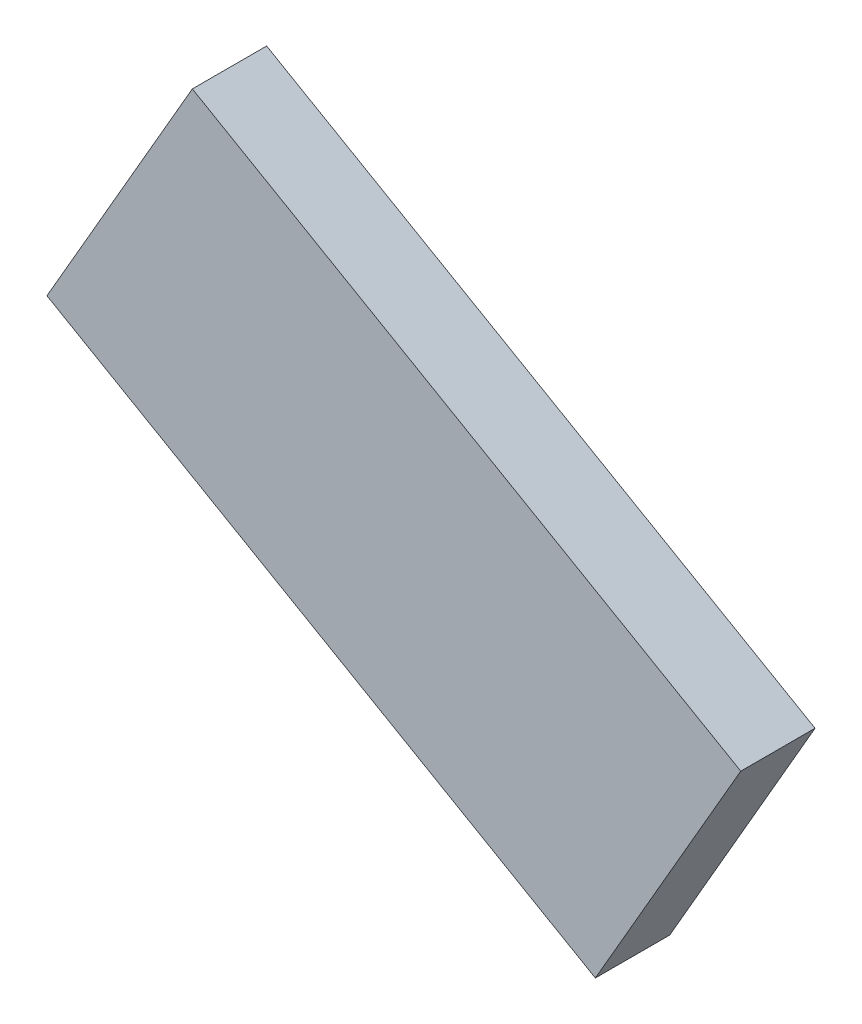
ISO-10303-21;
HEADER;
FILE_DESCRIPTION(('STEP AP214'),'2;1');
FILE_NAME('part.step','',(''),(''),'','','');
FILE_SCHEMA(('AUTOMOTIVE_DESIGN { 1 0 10303 214 1 1 1 1 }'));
ENDSEC;
DATA;
#1=APPLICATION_CONTEXT('core data for automotive mechanical design processes');
#2=APPLICATION_PROTOCOL_DEFINITION('international standard','automotive_design',2000,#1);
#3=PRODUCT_CONTEXT('',#1,'mechanical');
#4=PRODUCT('Part','Part','',(#3));
#5=PRODUCT_RELATED_PRODUCT_CATEGORY('part','',(#4));
#6=PRODUCT_DEFINITION_FORMATION('','',#4);
#7=PRODUCT_DEFINITION_CONTEXT('part definition',#1,'design');
#8=PRODUCT_DEFINITION('design','',#6,#7);
#9=PRODUCT_DEFINITION_SHAPE('','',#8);
#10=(LENGTH_UNIT() NAMED_UNIT(*) SI_UNIT(.MILLI.,.METRE.));
#11=(NAMED_UNIT(*) PLANE_ANGLE_UNIT() SI_UNIT($,.RADIAN.));
#12=(NAMED_UNIT(*) SI_UNIT($,.STERADIAN.) SOLID_ANGLE_UNIT());
#13=UNCERTAINTY_MEASURE_WITH_UNIT(LENGTH_MEASURE(1.E-05),#10,'distance_accuracy_value','');
#14=(GEOMETRIC_REPRESENTATION_CONTEXT(3) GLOBAL_UNCERTAINTY_ASSIGNED_CONTEXT((#13)) GLOBAL_UNIT_ASSIGNED_CONTEXT((#10,
#11,#12)) REPRESENTATION_CONTEXT('',''));
#15=CARTESIAN_POINT('',(0.,0.,0.));
#16=DIRECTION('',(0.,0.,1.));
#17=DIRECTION('',(1.,0.,0.));
#18=AXIS2_PLACEMENT_3D('',#15,#16,#17);
#19=CARTESIAN_POINT('',(5.36852622,-0.50144172,1.15000024));
#20=DIRECTION('',(0.,0.,-1.));
#21=DIRECTION('',(-1.,0.,0.));
#22=AXIS2_PLACEMENT_3D('',#19,#20,#21);
#23=PLANE('',#22);
#24=DIRECTION('',(0.500000090607198,0.866025351472342,0.));
#25=VECTOR('',#24,1.);
#26=CARTESIAN_POINT('',(-3.1185231,4.39855864,1.15000024));
#27=LINE('',#26,#25);
#28=CARTESIAN_POINT('',(-3.11852309999984,4.39855864000029,1.15000024));
#29=VERTEX_POINT('',#28);
#30=CARTESIAN_POINT('',(-5.36852367999981,0.501444259999892,1.15000024));
#31=VERTEX_POINT('',#30);
#32=EDGE_CURVE('E54',#29,#31,#27,.F.);
#33=ORIENTED_EDGE('',*,*,#32,.T.);
#34=DIRECTION('',(-0.866025397135755,0.500000011515858,0.));
#35=VECTOR('',#34,1.);
#36=CARTESIAN_POINT('',(-5.36852368,0.50144426,1.15000024));
#37=LINE('',#36,#35);
#38=CARTESIAN_POINT('',(3.11852563999984,-4.39855610000029,1.15000024));
#39=VERTEX_POINT('',#38);
#40=EDGE_CURVE('E56',#31,#39,#37,.F.);
#41=ORIENTED_EDGE('',*,*,#40,.T.);
#42=DIRECTION('',(-0.500000090607198,-0.866025351472342,0.));
#43=VECTOR('',#42,1.);
#44=CARTESIAN_POINT('',(3.11852564,-4.3985561,1.15000024));
#45=LINE('',#44,#43);
#46=CARTESIAN_POINT('',(5.36852621999963,-0.501441719999784,1.15000024));
#47=VERTEX_POINT('',#46);
#48=EDGE_CURVE('E19',#39,#47,#45,.F.);
#49=ORIENTED_EDGE('',*,*,#48,.T.);
#50=DIRECTION('',(0.866025397135755,-0.500000011515858,0.));
#51=VECTOR('',#50,1.);
#52=CARTESIAN_POINT('',(5.36852622,-0.50144172,1.15000024));
#53=LINE('',#52,#51);
#54=EDGE_CURVE('E79',#47,#29,#53,.F.);
#55=ORIENTED_EDGE('',*,*,#54,.T.);
#56=EDGE_LOOP('',(#33,#41,#49,#55));
#57=FACE_BOUND('',#56,.T.);
#58=ADVANCED_FACE('F16',(#57),#23,.F.);
#59=CARTESIAN_POINT('',(3.11852564,-4.3985561,0.));
#60=DIRECTION('',(-0.866025351472342,0.500000090607198,0.));
#61=DIRECTION('',(-0.500000090607198,-0.866025351472342,0.));
#62=AXIS2_PLACEMENT_3D('',#59,#60,#61);
#63=PLANE('',#62);
#64=DIRECTION('',(0.,0.,1.));
#65=VECTOR('',#64,1.);
#66=CARTESIAN_POINT('',(5.36852622,-0.50144172,0.));
#67=LINE('',#66,#65);
#68=CARTESIAN_POINT('',(5.36852621999963,-0.501441719999784,0.));
#69=VERTEX_POINT('',#68);
#70=EDGE_CURVE('E67',#69,#47,#67,.T.);
#71=ORIENTED_EDGE('',*,*,#70,.T.);
#72=ORIENTED_EDGE('',*,*,#48,.F.);
#73=DIRECTION('',(0.,0.,1.));
#74=VECTOR('',#73,1.);
#75=CARTESIAN_POINT('',(3.11852563999934,-4.39855610000114,0.));
#76=LINE('',#75,#74);
#77=CARTESIAN_POINT('',(3.11852563999984,-4.39855610000029,0.));
#78=VERTEX_POINT('',#77);
#79=EDGE_CURVE('E62',#39,#78,#76,.F.);
#80=ORIENTED_EDGE('',*,*,#79,.T.);
#81=DIRECTION('',(-0.500000090607363,-0.866025351472247,0.));
#82=VECTOR('',#81,1.);
#83=CARTESIAN_POINT('',(5.36852622,-0.50144172,0.));
#84=LINE('',#83,#82);
#85=EDGE_CURVE('E82',#69,#78,#84,.T.);
#86=ORIENTED_EDGE('',*,*,#85,.F.);
#87=EDGE_LOOP('',(#71,#72,#80,#86));
#88=FACE_BOUND('',#87,.T.);
#89=ADVANCED_FACE('F64',(#88),#63,.F.);
#90=CARTESIAN_POINT('',(-5.36852368,0.50144426,0.));
#91=DIRECTION('',(0.500000011515858,0.866025397135755,0.));
#92=DIRECTION('',(-0.866025397135755,0.500000011515858,0.));
#93=AXIS2_PLACEMENT_3D('',#90,#91,#92);
#94=PLANE('',#93);
#95=ORIENTED_EDGE('',*,*,#79,.F.);
#96=ORIENTED_EDGE('',*,*,#40,.F.);
#97=DIRECTION('',(0.,0.,1.));
#98=VECTOR('',#97,1.);
#99=CARTESIAN_POINT('',(-5.36852367999925,0.501444259999569,0.));
#100=LINE('',#99,#98);
#101=CARTESIAN_POINT('',(-5.36852367999981,0.501444259999892,0.));
#102=VERTEX_POINT('',#101);
#103=EDGE_CURVE('E74',#31,#102,#100,.F.);
#104=ORIENTED_EDGE('',*,*,#103,.T.);
#105=DIRECTION('',(-0.866025397135822,0.500000011515742,0.));
#106=VECTOR('',#105,1.);
#107=CARTESIAN_POINT('',(3.11852564,-4.3985561,0.));
#108=LINE('',#107,#106);
#109=EDGE_CURVE('E71',#78,#102,#108,.T.);
#110=ORIENTED_EDGE('',*,*,#109,.F.);
#111=EDGE_LOOP('',(#95,#96,#104,#110));
#112=FACE_BOUND('',#111,.T.);
#113=ADVANCED_FACE('F69',(#112),#94,.F.);
#114=CARTESIAN_POINT('',(-3.1185231,4.39855864,0.));
#115=DIRECTION('',(0.866025351472342,-0.500000090607198,0.));
#116=DIRECTION('',(0.500000090607198,0.866025351472342,0.));
#117=AXIS2_PLACEMENT_3D('',#114,#115,#116);
#118=PLANE('',#117);
#119=ORIENTED_EDGE('',*,*,#103,.F.);
#120=ORIENTED_EDGE('',*,*,#32,.F.);
#121=DIRECTION('',(0.,0.,1.));
#122=VECTOR('',#121,1.);
#123=CARTESIAN_POINT('',(-3.11852309999934,4.39855864000114,0.));
#124=LINE('',#123,#122);
#125=CARTESIAN_POINT('',(-3.11852309999984,4.39855864000029,0.));
#126=VERTEX_POINT('',#125);
#127=EDGE_CURVE('E34',#29,#126,#124,.F.);
#128=ORIENTED_EDGE('',*,*,#127,.T.);
#129=DIRECTION('',(0.500000090607363,0.866025351472247,0.));
#130=VECTOR('',#129,1.);
#131=CARTESIAN_POINT('',(-5.36852368,0.50144426,0.));
#132=LINE('',#131,#130);
#133=EDGE_CURVE('E25',#102,#126,#132,.T.);
#134=ORIENTED_EDGE('',*,*,#133,.F.);
#135=EDGE_LOOP('',(#119,#120,#128,#134));
#136=FACE_BOUND('',#135,.T.);
#137=ADVANCED_FACE('F88',(#136),#118,.F.);
#138=CARTESIAN_POINT('',(5.36852622,-0.50144172,0.));
#139=DIRECTION('',(-0.500000011515858,-0.866025397135755,0.));
#140=DIRECTION('',(0.866025397135755,-0.500000011515858,0.));
#141=AXIS2_PLACEMENT_3D('',#138,#139,#140);
#142=PLANE('',#141);
#143=ORIENTED_EDGE('',*,*,#127,.F.);
#144=ORIENTED_EDGE('',*,*,#54,.F.);
#145=ORIENTED_EDGE('',*,*,#70,.F.);
#146=DIRECTION('',(0.866025397135822,-0.500000011515742,0.));
#147=VECTOR('',#146,1.);
#148=CARTESIAN_POINT('',(-3.1185231,4.39855864,0.));
#149=LINE('',#148,#147);
#150=EDGE_CURVE('E11',#126,#69,#149,.T.);
#151=ORIENTED_EDGE('',*,*,#150,.F.);
#152=EDGE_LOOP('',(#143,#144,#145,#151));
#153=FACE_BOUND('',#152,.T.);
#154=ADVANCED_FACE('F90',(#153),#142,.F.);
#155=CARTESIAN_POINT('',(5.36852622,-0.50144172,0.));
#156=DIRECTION('',(0.,0.,-1.));
#157=DIRECTION('',(-1.,0.,0.));
#158=AXIS2_PLACEMENT_3D('',#155,#156,#157);
#159=PLANE('',#158);
#160=ORIENTED_EDGE('',*,*,#133,.T.);
#161=ORIENTED_EDGE('',*,*,#150,.T.);
#162=ORIENTED_EDGE('',*,*,#85,.T.);
#163=ORIENTED_EDGE('',*,*,#109,.T.);
#164=EDGE_LOOP('',(#160,#161,#162,#163));
#165=FACE_BOUND('',#164,.T.);
#166=ADVANCED_FACE('F87',(#165),#159,.T.);
#167=CLOSED_SHELL('',(#58,#89,#113,#137,#154,#166));
#168=MANIFOLD_SOLID_BREP('B1',#167);
#169=ADVANCED_BREP_SHAPE_REPRESENTATION('',(#18,#168),#14);
#170=SHAPE_DEFINITION_REPRESENTATION(#9,#169);
ENDSEC;
END-ISO-10303-21;
